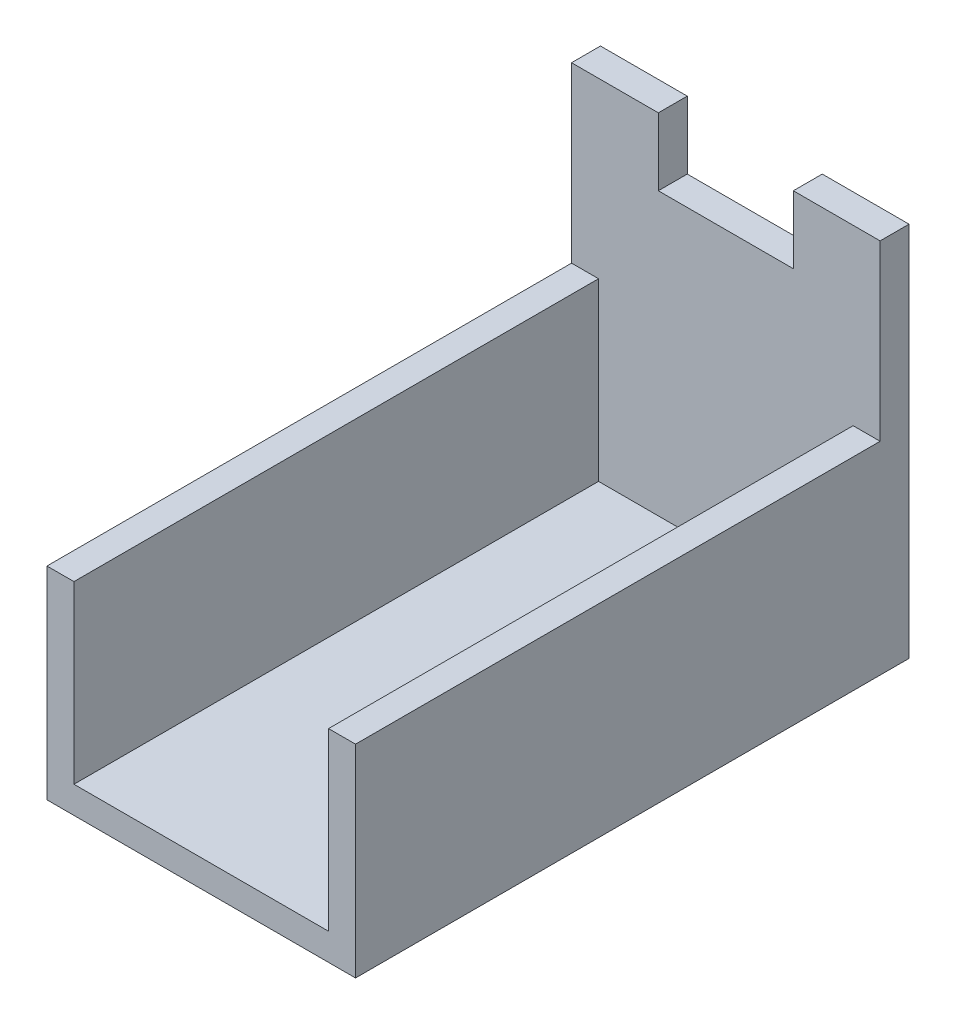
ISO-10303-21;
HEADER;
FILE_DESCRIPTION(('STEP AP214'),'2;1');
FILE_NAME('part.step','',(''),(''),'','','');
FILE_SCHEMA(('AUTOMOTIVE_DESIGN { 1 0 10303 214 1 1 1 1 }'));
ENDSEC;
DATA;
#1=APPLICATION_CONTEXT('core data for automotive mechanical design processes');
#2=APPLICATION_PROTOCOL_DEFINITION('international standard','automotive_design',2000,#1);
#3=PRODUCT_CONTEXT('',#1,'mechanical');
#4=PRODUCT('Part','Part','',(#3));
#5=PRODUCT_RELATED_PRODUCT_CATEGORY('part','',(#4));
#6=PRODUCT_DEFINITION_FORMATION('','',#4);
#7=PRODUCT_DEFINITION_CONTEXT('part definition',#1,'design');
#8=PRODUCT_DEFINITION('design','',#6,#7);
#9=PRODUCT_DEFINITION_SHAPE('','',#8);
#10=(LENGTH_UNIT() NAMED_UNIT(*) SI_UNIT(.MILLI.,.METRE.));
#11=(NAMED_UNIT(*) PLANE_ANGLE_UNIT() SI_UNIT($,.RADIAN.));
#12=(NAMED_UNIT(*) SI_UNIT($,.STERADIAN.) SOLID_ANGLE_UNIT());
#13=UNCERTAINTY_MEASURE_WITH_UNIT(LENGTH_MEASURE(1.E-05),#10,'distance_accuracy_value','');
#14=(GEOMETRIC_REPRESENTATION_CONTEXT(3) GLOBAL_UNCERTAINTY_ASSIGNED_CONTEXT((#13)) GLOBAL_UNIT_ASSIGNED_CONTEXT((#10,
#11,#12)) REPRESENTATION_CONTEXT('',''));
#15=CARTESIAN_POINT('',(0.,0.,0.));
#16=DIRECTION('',(0.,0.,1.));
#17=DIRECTION('',(1.,0.,0.));
#18=AXIS2_PLACEMENT_3D('',#15,#16,#17);
#19=CARTESIAN_POINT('',(0.,24.6792515653518,0.));
#20=DIRECTION('',(0.,1.,0.));
#21=DIRECTION('',(0.,0.,1.));
#22=AXIS2_PLACEMENT_3D('',#19,#20,#21);
#23=PLANE('',#22);
#24=DIRECTION('',(0.,0.,-1.));
#25=VECTOR('',#24,1.);
#26=CARTESIAN_POINT('',(-14.3509999999999,24.6792515653518,0.001000000000001));
#27=LINE('',#26,#25);
#28=CARTESIAN_POINT('',(-14.3509999999999,24.6792515653518,-34.544));
#29=VERTEX_POINT('',#28);
#30=CARTESIAN_POINT('',(-14.3509999999999,24.6792515653518,-36.449));
#31=VERTEX_POINT('',#30);
#32=EDGE_CURVE('E313',#29,#31,#27,.T.);
#33=ORIENTED_EDGE('',*,*,#32,.T.);
#34=DIRECTION('',(-1.,0.,0.));
#35=VECTOR('',#34,1.);
#36=CARTESIAN_POINT('',(0.254000000000063,24.6792515653518,-36.449));
#37=LINE('',#36,#35);
#38=CARTESIAN_POINT('',(-20.0659999999999,24.6792515653518,-36.449));
#39=VERTEX_POINT('',#38);
#40=EDGE_CURVE('E176',#31,#39,#37,.T.);
#41=ORIENTED_EDGE('',*,*,#40,.T.);
#42=DIRECTION('',(0.,0.,1.));
#43=VECTOR('',#42,1.);
#44=CARTESIAN_POINT('',(-20.0659999999999,24.6792515653518,-36.449));
#45=LINE('',#44,#43);
#46=CARTESIAN_POINT('',(-20.0659999999999,24.6792515653518,-34.544));
#47=VERTEX_POINT('',#46);
#48=EDGE_CURVE('E175',#39,#47,#45,.T.);
#49=ORIENTED_EDGE('',*,*,#48,.T.);
#50=DIRECTION('',(1.,0.,0.));
#51=VECTOR('',#50,1.);
#52=CARTESIAN_POINT('',(-20.0659999999999,24.6792515653518,-34.544));
#53=LINE('',#52,#51);
#54=EDGE_CURVE('E304',#47,#29,#53,.T.);
#55=ORIENTED_EDGE('',*,*,#54,.T.);
#56=EDGE_LOOP('',(#33,#41,#49,#55));
#57=FACE_BOUND('',#56,.T.);
#58=ADVANCED_FACE('F43',(#57),#23,.T.);
#59=CARTESIAN_POINT('',(-1.52399999999994,13.2492515653518,-36.449));
#60=DIRECTION('',(0.,1.,0.));
#61=DIRECTION('',(0.,0.,1.));
#62=AXIS2_PLACEMENT_3D('',#59,#60,#61);
#63=PLANE('',#62);
#64=DIRECTION('',(1.,0.,0.));
#65=VECTOR('',#64,1.);
#66=CARTESIAN_POINT('',(-9.90599999999994,13.2492515653518,-34.544));
#67=LINE('',#66,#65);
#68=CARTESIAN_POINT('',(-20.0659999999999,13.2492515653518,-34.544));
#69=VERTEX_POINT('',#68);
#70=CARTESIAN_POINT('',(-18.2879999999999,13.2492515653518,-34.544));
#71=VERTEX_POINT('',#70);
#72=EDGE_CURVE('E55',#69,#71,#67,.T.);
#73=ORIENTED_EDGE('',*,*,#72,.F.);
#74=DIRECTION('',(0.,0.,1.));
#75=VECTOR('',#74,1.);
#76=CARTESIAN_POINT('',(-20.0659999999999,13.2492515653518,-36.449));
#77=LINE('',#76,#75);
#78=CARTESIAN_POINT('',(-20.0659999999999,13.2492515653518,0.));
#79=VERTEX_POINT('',#78);
#80=EDGE_CURVE('E262',#69,#79,#77,.T.);
#81=ORIENTED_EDGE('',*,*,#80,.T.);
#82=DIRECTION('',(-1.,0.,0.));
#83=VECTOR('',#82,1.);
#84=CARTESIAN_POINT('',(-20.0659999999999,13.2492515653518,0.));
#85=LINE('',#84,#83);
#86=CARTESIAN_POINT('',(-18.2879999999999,13.2492515653518,0.));
#87=VERTEX_POINT('',#86);
#88=EDGE_CURVE('E225',#87,#79,#85,.T.);
#89=ORIENTED_EDGE('',*,*,#88,.F.);
#90=DIRECTION('',(0.,0.,1.));
#91=VECTOR('',#90,1.);
#92=CARTESIAN_POINT('',(-18.2879999999999,13.2492515653518,-36.449));
#93=LINE('',#92,#91);
#94=EDGE_CURVE('E264',#71,#87,#93,.T.);
#95=ORIENTED_EDGE('',*,*,#94,.F.);
#96=EDGE_LOOP('',(#73,#81,#89,#95));
#97=FACE_BOUND('',#96,.T.);
#98=ADVANCED_FACE('F286',(#97),#63,.T.);
#99=CARTESIAN_POINT('',(-18.2879999999999,1.69225156535182,-36.449));
#100=DIRECTION('',(0.,1.,0.));
#101=DIRECTION('',(0.,0.,1.));
#102=AXIS2_PLACEMENT_3D('',#99,#100,#101);
#103=PLANE('',#102);
#104=DIRECTION('',(0.,0.,1.));
#105=VECTOR('',#104,1.);
#106=CARTESIAN_POINT('',(-1.52399999999994,1.69225156535182,-36.449));
#107=LINE('',#106,#105);
#108=CARTESIAN_POINT('',(-1.52399999999994,1.69225156535182,-34.544));
#109=VERTEX_POINT('',#108);
#110=CARTESIAN_POINT('',(-1.52399999999994,1.69225156535182,0.));
#111=VERTEX_POINT('',#110);
#112=EDGE_CURVE('E53',#109,#111,#107,.T.);
#113=ORIENTED_EDGE('',*,*,#112,.F.);
#114=DIRECTION('',(1.,0.,0.));
#115=VECTOR('',#114,1.);
#116=CARTESIAN_POINT('',(-1.52399999999994,1.69225156535182,-34.544));
#117=LINE('',#116,#115);
#118=CARTESIAN_POINT('',(-18.2879999999999,1.69225156535182,-34.544));
#119=VERTEX_POINT('',#118);
#120=EDGE_CURVE('E195',#119,#109,#117,.T.);
#121=ORIENTED_EDGE('',*,*,#120,.F.);
#122=DIRECTION('',(0.,0.,1.));
#123=VECTOR('',#122,1.);
#124=CARTESIAN_POINT('',(-18.2879999999999,1.69225156535182,-36.449));
#125=LINE('',#124,#123);
#126=CARTESIAN_POINT('',(-18.2879999999999,1.69225156535182,0.));
#127=VERTEX_POINT('',#126);
#128=EDGE_CURVE('E47',#119,#127,#125,.T.);
#129=ORIENTED_EDGE('',*,*,#128,.T.);
#130=DIRECTION('',(-1.,0.,0.));
#131=VECTOR('',#130,1.);
#132=CARTESIAN_POINT('',(-18.2879999999999,1.69225156535182,0.));
#133=LINE('',#132,#131);
#134=EDGE_CURVE('E205',#111,#127,#133,.T.);
#135=ORIENTED_EDGE('',*,*,#134,.F.);
#136=EDGE_LOOP('',(#113,#121,#129,#135));
#137=FACE_BOUND('',#136,.T.);
#138=ADVANCED_FACE('F45',(#137),#103,.T.);
#139=CARTESIAN_POINT('',(-1.52399999999994,1.69225156535182,-36.449));
#140=DIRECTION('',(-1.,0.,0.));
#141=DIRECTION('',(0.,0.,1.));
#142=AXIS2_PLACEMENT_3D('',#139,#140,#141);
#143=PLANE('',#142);
#144=DIRECTION('',(0.,0.,1.));
#145=VECTOR('',#144,1.);
#146=CARTESIAN_POINT('',(-1.52399999999994,13.2492515653518,-36.449));
#147=LINE('',#146,#145);
#148=CARTESIAN_POINT('',(-1.52399999999994,13.2492515653518,-34.544));
#149=VERTEX_POINT('',#148);
#150=CARTESIAN_POINT('',(-1.52399999999994,13.2492515653518,0.));
#151=VERTEX_POINT('',#150);
#152=EDGE_CURVE('E250',#149,#151,#147,.T.);
#153=ORIENTED_EDGE('',*,*,#152,.F.);
#154=DIRECTION('',(0.,-1.,0.));
#155=VECTOR('',#154,1.);
#156=CARTESIAN_POINT('',(-1.52399999999994,30.121143012371,-34.544));
#157=LINE('',#156,#155);
#158=EDGE_CURVE('E199',#149,#109,#157,.T.);
#159=ORIENTED_EDGE('',*,*,#158,.T.);
#160=ORIENTED_EDGE('',*,*,#112,.T.);
#161=DIRECTION('',(0.,-1.,0.));
#162=VECTOR('',#161,1.);
#163=CARTESIAN_POINT('',(-1.52399999999994,1.69225156535182,0.));
#164=LINE('',#163,#162);
#165=EDGE_CURVE('E211',#151,#111,#164,.T.);
#166=ORIENTED_EDGE('',*,*,#165,.F.);
#167=EDGE_LOOP('',(#153,#159,#160,#166));
#168=FACE_BOUND('',#167,.T.);
#169=ADVANCED_FACE('F281',(#168),#143,.T.);
#170=CARTESIAN_POINT('',(-18.2879999999999,13.2492515653518,-36.449));
#171=DIRECTION('',(1.,0.,0.));
#172=DIRECTION('',(0.,0.,-1.));
#173=AXIS2_PLACEMENT_3D('',#170,#171,#172);
#174=PLANE('',#173);
#175=ORIENTED_EDGE('',*,*,#128,.F.);
#176=DIRECTION('',(0.,-1.,0.));
#177=VECTOR('',#176,1.);
#178=CARTESIAN_POINT('',(-18.2879999999999,30.121143012371,-34.544));
#179=LINE('',#178,#177);
#180=EDGE_CURVE('E194',#71,#119,#179,.T.);
#181=ORIENTED_EDGE('',*,*,#180,.F.);
#182=ORIENTED_EDGE('',*,*,#94,.T.);
#183=DIRECTION('',(0.,1.,0.));
#184=VECTOR('',#183,1.);
#185=CARTESIAN_POINT('',(-18.2879999999999,13.2492515653518,0.));
#186=LINE('',#185,#184);
#187=EDGE_CURVE('E221',#127,#87,#186,.T.);
#188=ORIENTED_EDGE('',*,*,#187,.F.);
#189=EDGE_LOOP('',(#175,#181,#182,#188));
#190=FACE_BOUND('',#189,.T.);
#191=ADVANCED_FACE('F274',(#190),#174,.T.);
#192=CARTESIAN_POINT('',(0.254000000000063,13.2492515653518,-34.544));
#193=VERTEX_POINT('',#192);
#194=EDGE_CURVE('E11',#149,#193,#67,.T.);
#195=ORIENTED_EDGE('',*,*,#194,.F.);
#196=ORIENTED_EDGE('',*,*,#152,.T.);
#197=DIRECTION('',(-1.,0.,0.));
#198=VECTOR('',#197,1.);
#199=CARTESIAN_POINT('',(-1.52399999999994,13.2492515653518,0.));
#200=LINE('',#199,#198);
#201=CARTESIAN_POINT('',(0.254000000000063,13.2492515653518,0.));
#202=VERTEX_POINT('',#201);
#203=EDGE_CURVE('E241',#202,#151,#200,.T.);
#204=ORIENTED_EDGE('',*,*,#203,.F.);
#205=DIRECTION('',(0.,0.,1.));
#206=VECTOR('',#205,1.);
#207=CARTESIAN_POINT('',(0.254000000000063,13.2492515653518,-36.449));
#208=LINE('',#207,#206);
#209=EDGE_CURVE('E253',#193,#202,#208,.T.);
#210=ORIENTED_EDGE('',*,*,#209,.F.);
#211=EDGE_LOOP('',(#195,#196,#204,#210));
#212=FACE_BOUND('',#211,.T.);
#213=ADVANCED_FACE('F302',(#212),#63,.T.);
#214=CARTESIAN_POINT('',(0.254000000000063,13.2492515653518,-36.449));
#215=DIRECTION('',(1.,0.,0.));
#216=DIRECTION('',(0.,1.,0.));
#217=AXIS2_PLACEMENT_3D('',#214,#215,#216);
#218=PLANE('',#217);
#219=DIRECTION('',(0.,1.,0.));
#220=VECTOR('',#219,1.);
#221=CARTESIAN_POINT('',(0.254000000000063,13.2492515653518,0.));
#222=LINE('',#221,#220);
#223=CARTESIAN_POINT('',(0.254000000000065,-0.0857484346481768,0.));
#224=VERTEX_POINT('',#223);
#225=EDGE_CURVE('E237',#224,#202,#222,.T.);
#226=ORIENTED_EDGE('',*,*,#225,.F.);
#227=DIRECTION('',(0.,0.,1.));
#228=VECTOR('',#227,1.);
#229=CARTESIAN_POINT('',(0.254000000000065,-0.0857484346481768,-36.449));
#230=LINE('',#229,#228);
#231=CARTESIAN_POINT('',(0.254000000000065,-0.0857484346481768,-36.449));
#232=VERTEX_POINT('',#231);
#233=EDGE_CURVE('E256',#232,#224,#230,.T.);
#234=ORIENTED_EDGE('',*,*,#233,.F.);
#235=DIRECTION('',(0.,1.,0.));
#236=VECTOR('',#235,1.);
#237=CARTESIAN_POINT('',(0.254000000000063,13.2492515653518,-36.449));
#238=LINE('',#237,#236);
#239=CARTESIAN_POINT('',(0.254000000000063,24.6792515653518,-36.449));
#240=VERTEX_POINT('',#239);
#241=EDGE_CURVE('E215',#232,#240,#238,.T.);
#242=ORIENTED_EDGE('',*,*,#241,.T.);
#243=DIRECTION('',(0.,0.,-1.));
#244=VECTOR('',#243,1.);
#245=CARTESIAN_POINT('',(0.254000000000063,24.6792515653518,-34.544));
#246=LINE('',#245,#244);
#247=CARTESIAN_POINT('',(0.254000000000063,24.6792515653518,-34.544));
#248=VERTEX_POINT('',#247);
#249=EDGE_CURVE('E173',#248,#240,#246,.T.);
#250=ORIENTED_EDGE('',*,*,#249,.F.);
#251=DIRECTION('',(0.,-1.,0.));
#252=VECTOR('',#251,1.);
#253=CARTESIAN_POINT('',(0.254000000000063,24.6792515653518,-34.544));
#254=LINE('',#253,#252);
#255=EDGE_CURVE('E190',#248,#193,#254,.T.);
#256=ORIENTED_EDGE('',*,*,#255,.T.);
#257=ORIENTED_EDGE('',*,*,#209,.T.);
#258=EDGE_LOOP('',(#226,#234,#242,#250,#256,#257));
#259=FACE_BOUND('',#258,.T.);
#260=ADVANCED_FACE('F299',(#259),#218,.T.);
#261=CARTESIAN_POINT('',(0.254000000000065,-0.0857484346481768,-36.449));
#262=DIRECTION('',(0.,-1.,0.));
#263=DIRECTION('',(1.,0.,0.));
#264=AXIS2_PLACEMENT_3D('',#261,#262,#263);
#265=PLANE('',#264);
#266=DIRECTION('',(1.,0.,0.));
#267=VECTOR('',#266,1.);
#268=CARTESIAN_POINT('',(0.254000000000065,-0.0857484346481768,0.));
#269=LINE('',#268,#267);
#270=CARTESIAN_POINT('',(-20.0659999999999,-0.0857484346481793,0.));
#271=VERTEX_POINT('',#270);
#272=EDGE_CURVE('E233',#271,#224,#269,.T.);
#273=ORIENTED_EDGE('',*,*,#272,.F.);
#274=DIRECTION('',(0.,0.,1.));
#275=VECTOR('',#274,1.);
#276=CARTESIAN_POINT('',(-20.0659999999999,-0.0857484346481793,-36.449));
#277=LINE('',#276,#275);
#278=CARTESIAN_POINT('',(-20.0659999999999,-0.0857484346481793,-36.449));
#279=VERTEX_POINT('',#278);
#280=EDGE_CURVE('E259',#279,#271,#277,.T.);
#281=ORIENTED_EDGE('',*,*,#280,.F.);
#282=DIRECTION('',(1.,0.,0.));
#283=VECTOR('',#282,1.);
#284=CARTESIAN_POINT('',(0.254000000000065,-0.0857484346481768,-36.449));
#285=LINE('',#284,#283);
#286=EDGE_CURVE('E210',#279,#232,#285,.T.);
#287=ORIENTED_EDGE('',*,*,#286,.T.);
#288=ORIENTED_EDGE('',*,*,#233,.T.);
#289=EDGE_LOOP('',(#273,#281,#287,#288));
#290=FACE_BOUND('',#289,.T.);
#291=ADVANCED_FACE('F296',(#290),#265,.T.);
#292=CARTESIAN_POINT('',(-20.0659999999999,-0.0857484346481793,-36.449));
#293=DIRECTION('',(-1.,0.,0.));
#294=DIRECTION('',(0.,0.,1.));
#295=AXIS2_PLACEMENT_3D('',#292,#293,#294);
#296=PLANE('',#295);
#297=DIRECTION('',(0.,-1.,0.));
#298=VECTOR('',#297,1.);
#299=CARTESIAN_POINT('',(-20.0659999999999,-0.0857484346481793,0.));
#300=LINE('',#299,#298);
#301=EDGE_CURVE('E229',#79,#271,#300,.T.);
#302=ORIENTED_EDGE('',*,*,#301,.F.);
#303=ORIENTED_EDGE('',*,*,#80,.F.);
#304=DIRECTION('',(0.,-1.,0.));
#305=VECTOR('',#304,1.);
#306=CARTESIAN_POINT('',(-20.0659999999999,24.6792515653518,-34.544));
#307=LINE('',#306,#305);
#308=EDGE_CURVE('E180',#47,#69,#307,.T.);
#309=ORIENTED_EDGE('',*,*,#308,.F.);
#310=ORIENTED_EDGE('',*,*,#48,.F.);
#311=DIRECTION('',(0.,-1.,0.));
#312=VECTOR('',#311,1.);
#313=CARTESIAN_POINT('',(-20.0659999999999,-0.0857484346481793,-36.449));
#314=LINE('',#313,#312);
#315=EDGE_CURVE('E206',#39,#279,#314,.T.);
#316=ORIENTED_EDGE('',*,*,#315,.T.);
#317=ORIENTED_EDGE('',*,*,#280,.T.);
#318=EDGE_LOOP('',(#302,#303,#309,#310,#316,#317));
#319=FACE_BOUND('',#318,.T.);
#320=ADVANCED_FACE('F290',(#319),#296,.T.);
#321=CARTESIAN_POINT('',(0.,0.,-36.449));
#322=DIRECTION('',(0.,0.,1.));
#323=DIRECTION('',(1.,0.,0.));
#324=AXIS2_PLACEMENT_3D('',#321,#322,#323);
#325=PLANE('',#324);
#326=ORIENTED_EDGE('',*,*,#40,.F.);
#327=DIRECTION('',(0.,1.,0.));
#328=VECTOR('',#327,1.);
#329=CARTESIAN_POINT('',(-14.3509999999999,24.6792515653518,-36.449));
#330=LINE('',#329,#328);
#331=CARTESIAN_POINT('',(-14.3509999999999,20.2342515653518,-36.449));
#332=VERTEX_POINT('',#331);
#333=EDGE_CURVE('E156',#332,#31,#330,.T.);
#334=ORIENTED_EDGE('',*,*,#333,.F.);
#335=DIRECTION('',(-1.,0.,0.));
#336=VECTOR('',#335,1.);
#337=CARTESIAN_POINT('',(-14.3509999999999,20.2342515653518,-36.449));
#338=LINE('',#337,#336);
#339=CARTESIAN_POINT('',(-5.46099999999994,20.2342515653518,-36.449));
#340=VERTEX_POINT('',#339);
#341=EDGE_CURVE('E166',#340,#332,#338,.T.);
#342=ORIENTED_EDGE('',*,*,#341,.F.);
#343=DIRECTION('',(0.,-1.,0.));
#344=VECTOR('',#343,1.);
#345=CARTESIAN_POINT('',(-5.46099999999994,20.2342515653518,-36.449));
#346=LINE('',#345,#344);
#347=CARTESIAN_POINT('',(-5.46099999999994,24.6792515653518,-36.449));
#348=VERTEX_POINT('',#347);
#349=EDGE_CURVE('E149',#348,#340,#346,.T.);
#350=ORIENTED_EDGE('',*,*,#349,.F.);
#351=EDGE_CURVE('E163',#240,#348,#37,.T.);
#352=ORIENTED_EDGE('',*,*,#351,.F.);
#353=ORIENTED_EDGE('',*,*,#241,.F.);
#354=ORIENTED_EDGE('',*,*,#286,.F.);
#355=ORIENTED_EDGE('',*,*,#315,.F.);
#356=EDGE_LOOP('',(#326,#334,#342,#350,#352,#353,#354,#355));
#357=FACE_BOUND('',#356,.T.);
#358=ADVANCED_FACE('F161',(#357),#325,.F.);
#359=CARTESIAN_POINT('',(0.,0.,0.));
#360=DIRECTION('',(0.,0.,1.));
#361=DIRECTION('',(1.,0.,0.));
#362=AXIS2_PLACEMENT_3D('',#359,#360,#361);
#363=PLANE('',#362);
#364=ORIENTED_EDGE('',*,*,#134,.T.);
#365=ORIENTED_EDGE('',*,*,#187,.T.);
#366=ORIENTED_EDGE('',*,*,#88,.T.);
#367=ORIENTED_EDGE('',*,*,#301,.T.);
#368=ORIENTED_EDGE('',*,*,#272,.T.);
#369=ORIENTED_EDGE('',*,*,#225,.T.);
#370=ORIENTED_EDGE('',*,*,#203,.T.);
#371=ORIENTED_EDGE('',*,*,#165,.T.);
#372=EDGE_LOOP('',(#364,#365,#366,#367,#368,#369,#370,#371));
#373=FACE_BOUND('',#372,.T.);
#374=ADVANCED_FACE('F276',(#373),#363,.T.);
#375=CARTESIAN_POINT('',(-1.52399999999994,30.121143012371,-34.544));
#376=DIRECTION('',(0.,0.,-1.));
#377=DIRECTION('',(-1.,0.,0.));
#378=AXIS2_PLACEMENT_3D('',#375,#376,#377);
#379=PLANE('',#378);
#380=DIRECTION('',(1.,0.,0.));
#381=VECTOR('',#380,1.);
#382=CARTESIAN_POINT('',(-14.3509999999999,20.2342515653518,-34.544));
#383=LINE('',#382,#381);
#384=CARTESIAN_POINT('',(-14.3509999999999,20.2342515653518,-34.544));
#385=VERTEX_POINT('',#384);
#386=CARTESIAN_POINT('',(-5.46099999999994,20.2342515653518,-34.544));
#387=VERTEX_POINT('',#386);
#388=EDGE_CURVE('E329',#385,#387,#383,.T.);
#389=ORIENTED_EDGE('',*,*,#388,.F.);
#390=DIRECTION('',(0.,-1.,0.));
#391=VECTOR('',#390,1.);
#392=CARTESIAN_POINT('',(-14.3509999999999,24.6792515653518,-34.544));
#393=LINE('',#392,#391);
#394=EDGE_CURVE('E168',#29,#385,#393,.T.);
#395=ORIENTED_EDGE('',*,*,#394,.F.);
#396=ORIENTED_EDGE('',*,*,#54,.F.);
#397=ORIENTED_EDGE('',*,*,#308,.T.);
#398=ORIENTED_EDGE('',*,*,#72,.T.);
#399=ORIENTED_EDGE('',*,*,#180,.T.);
#400=ORIENTED_EDGE('',*,*,#120,.T.);
#401=ORIENTED_EDGE('',*,*,#158,.F.);
#402=ORIENTED_EDGE('',*,*,#194,.T.);
#403=ORIENTED_EDGE('',*,*,#255,.F.);
#404=CARTESIAN_POINT('',(-5.46099999999994,24.6792515653518,-34.544));
#405=VERTEX_POINT('',#404);
#406=EDGE_CURVE('E186',#405,#248,#53,.T.);
#407=ORIENTED_EDGE('',*,*,#406,.F.);
#408=DIRECTION('',(0.,1.,0.));
#409=VECTOR('',#408,1.);
#410=CARTESIAN_POINT('',(-5.46099999999994,20.2342515653518,-34.544));
#411=LINE('',#410,#409);
#412=EDGE_CURVE('E62',#387,#405,#411,.T.);
#413=ORIENTED_EDGE('',*,*,#412,.F.);
#414=EDGE_LOOP('',(#389,#395,#396,#397,#398,#399,#400,#401,#402,#403,#407,#413));
#415=FACE_BOUND('',#414,.T.);
#416=ADVANCED_FACE('F285',(#415),#379,.F.);
#417=DIRECTION('',(0.,0.,-1.));
#418=VECTOR('',#417,1.);
#419=CARTESIAN_POINT('',(-5.46099999999994,24.6792515653518,0.001000000000001));
#420=LINE('',#419,#418);
#421=EDGE_CURVE('E146',#405,#348,#420,.T.);
#422=ORIENTED_EDGE('',*,*,#421,.F.);
#423=ORIENTED_EDGE('',*,*,#406,.T.);
#424=ORIENTED_EDGE('',*,*,#249,.T.);
#425=ORIENTED_EDGE('',*,*,#351,.T.);
#426=EDGE_LOOP('',(#422,#423,#424,#425));
#427=FACE_BOUND('',#426,.T.);
#428=ADVANCED_FACE('F171',(#427),#23,.T.);
#429=CARTESIAN_POINT('',(-14.3509999999999,24.6792515653518,0.001000000000001));
#430=DIRECTION('',(-1.,0.,0.));
#431=DIRECTION('',(0.,-1.,0.));
#432=AXIS2_PLACEMENT_3D('',#429,#430,#431);
#433=PLANE('',#432);
#434=ORIENTED_EDGE('',*,*,#394,.T.);
#435=DIRECTION('',(0.,0.,-1.));
#436=VECTOR('',#435,1.);
#437=CARTESIAN_POINT('',(-14.3509999999999,20.2342515653518,0.001000000000001));
#438=LINE('',#437,#436);
#439=EDGE_CURVE('E317',#385,#332,#438,.T.);
#440=ORIENTED_EDGE('',*,*,#439,.T.);
#441=ORIENTED_EDGE('',*,*,#333,.T.);
#442=ORIENTED_EDGE('',*,*,#32,.F.);
#443=EDGE_LOOP('',(#434,#440,#441,#442));
#444=FACE_BOUND('',#443,.T.);
#445=ADVANCED_FACE('F336',(#444),#433,.F.);
#446=CARTESIAN_POINT('',(-14.3509999999999,20.2342515653518,0.001000000000001));
#447=DIRECTION('',(0.,-1.,0.));
#448=DIRECTION('',(0.,0.,-1.));
#449=AXIS2_PLACEMENT_3D('',#446,#447,#448);
#450=PLANE('',#449);
#451=ORIENTED_EDGE('',*,*,#388,.T.);
#452=DIRECTION('',(0.,0.,-1.));
#453=VECTOR('',#452,1.);
#454=CARTESIAN_POINT('',(-5.46099999999994,20.2342515653518,0.001000000000001));
#455=LINE('',#454,#453);
#456=EDGE_CURVE('E155',#387,#340,#455,.T.);
#457=ORIENTED_EDGE('',*,*,#456,.T.);
#458=ORIENTED_EDGE('',*,*,#341,.T.);
#459=ORIENTED_EDGE('',*,*,#439,.F.);
#460=EDGE_LOOP('',(#451,#457,#458,#459));
#461=FACE_BOUND('',#460,.T.);
#462=ADVANCED_FACE('F333',(#461),#450,.F.);
#463=CARTESIAN_POINT('',(-5.46099999999994,20.2342515653518,0.001000000000001));
#464=DIRECTION('',(1.,0.,0.));
#465=DIRECTION('',(0.,0.,-1.));
#466=AXIS2_PLACEMENT_3D('',#463,#464,#465);
#467=PLANE('',#466);
#468=ORIENTED_EDGE('',*,*,#412,.T.);
#469=ORIENTED_EDGE('',*,*,#421,.T.);
#470=ORIENTED_EDGE('',*,*,#349,.T.);
#471=ORIENTED_EDGE('',*,*,#456,.F.);
#472=EDGE_LOOP('',(#468,#469,#470,#471));
#473=FACE_BOUND('',#472,.T.);
#474=ADVANCED_FACE('F148',(#473),#467,.F.);
#475=CLOSED_SHELL('',(#58,#98,#138,#169,#191,#213,#260,#291,#320,#358,#374,#416,#428,#445,#462,#474));
#476=MANIFOLD_SOLID_BREP('B2',#475);
#477=ADVANCED_BREP_SHAPE_REPRESENTATION('',(#18,#476),#14);
#478=SHAPE_DEFINITION_REPRESENTATION(#9,#477);
ENDSEC;
END-ISO-10303-21;
